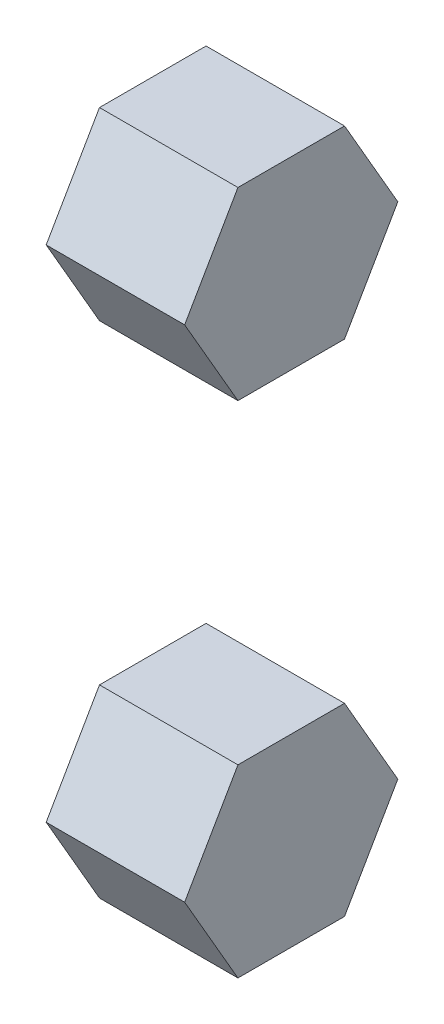
ISO-10303-21;
HEADER;
FILE_DESCRIPTION(('STEP AP214'),'2;1');
FILE_NAME('part.step','',(''),(''),'','','');
FILE_SCHEMA(('AUTOMOTIVE_DESIGN { 1 0 10303 214 1 1 1 1 }'));
ENDSEC;
DATA;
#1=APPLICATION_CONTEXT('core data for automotive mechanical design processes');
#2=APPLICATION_PROTOCOL_DEFINITION('international standard','automotive_design',2000,#1);
#3=PRODUCT_CONTEXT('',#1,'mechanical');
#4=PRODUCT('Part','Part','',(#3));
#5=PRODUCT_RELATED_PRODUCT_CATEGORY('part','',(#4));
#6=PRODUCT_DEFINITION_FORMATION('','',#4);
#7=PRODUCT_DEFINITION_CONTEXT('part definition',#1,'design');
#8=PRODUCT_DEFINITION('design','',#6,#7);
#9=PRODUCT_DEFINITION_SHAPE('','',#8);
#10=(LENGTH_UNIT() NAMED_UNIT(*) SI_UNIT(.MILLI.,.METRE.));
#11=(NAMED_UNIT(*) PLANE_ANGLE_UNIT() SI_UNIT($,.RADIAN.));
#12=(NAMED_UNIT(*) SI_UNIT($,.STERADIAN.) SOLID_ANGLE_UNIT());
#13=UNCERTAINTY_MEASURE_WITH_UNIT(LENGTH_MEASURE(1.E-05),#10,'distance_accuracy_value','');
#14=(GEOMETRIC_REPRESENTATION_CONTEXT(3) GLOBAL_UNCERTAINTY_ASSIGNED_CONTEXT((#13)) GLOBAL_UNIT_ASSIGNED_CONTEXT((#10,
#11,#12)) REPRESENTATION_CONTEXT('',''));
#15=CARTESIAN_POINT('',(0.,0.,0.));
#16=DIRECTION('',(0.,0.,1.));
#17=DIRECTION('',(1.,0.,0.));
#18=AXIS2_PLACEMENT_3D('',#15,#16,#17);
#19=CARTESIAN_POINT('',(18.,613.,183.));
#20=DIRECTION('',(0.,-0.5,-0.86602540378444));
#21=DIRECTION('',(0.,-0.86602540378444,0.5));
#22=AXIS2_PLACEMENT_3D('',#19,#20,#21);
#23=PLANE('',#22);
#24=DIRECTION('',(0.,-0.86602540378444,0.5));
#25=VECTOR('',#24,1.);
#26=CARTESIAN_POINT('',(0.,613.,183.));
#27=LINE('',#26,#25);
#28=CARTESIAN_POINT('',(0.,613.,183.));
#29=VERTEX_POINT('',#28);
#30=CARTESIAN_POINT('',(0.,601.,189.928203230275));
#31=VERTEX_POINT('',#30);
#32=EDGE_CURVE('E144',#29,#31,#27,.T.);
#33=ORIENTED_EDGE('',*,*,#32,.T.);
#34=DIRECTION('',(-1.,0.,0.));
#35=VECTOR('',#34,1.);
#36=CARTESIAN_POINT('',(18.,601.,189.928203230275));
#37=LINE('',#36,#35);
#38=CARTESIAN_POINT('',(18.,601.,189.928203230275));
#39=VERTEX_POINT('',#38);
#40=EDGE_CURVE('E11',#39,#31,#37,.T.);
#41=ORIENTED_EDGE('',*,*,#40,.F.);
#42=DIRECTION('',(0.,-0.86602540378444,0.5));
#43=VECTOR('',#42,1.);
#44=CARTESIAN_POINT('',(18.,613.,183.));
#45=LINE('',#44,#43);
#46=CARTESIAN_POINT('',(18.,613.,183.));
#47=VERTEX_POINT('',#46);
#48=EDGE_CURVE('E587',#47,#39,#45,.T.);
#49=ORIENTED_EDGE('',*,*,#48,.F.);
#50=DIRECTION('',(-1.,0.,0.));
#51=VECTOR('',#50,1.);
#52=CARTESIAN_POINT('',(18.,613.,183.));
#53=LINE('',#52,#51);
#54=EDGE_CURVE('E162',#47,#29,#53,.T.);
#55=ORIENTED_EDGE('',*,*,#54,.T.);
#56=EDGE_LOOP('',(#33,#41,#49,#55));
#57=FACE_BOUND('',#56,.T.);
#58=ADVANCED_FACE('F17',(#57),#23,.F.);
#59=CARTESIAN_POINT('',(18.,601.,189.928203230275));
#60=DIRECTION('',(0.,0.5,-0.86602540378444));
#61=DIRECTION('',(0.,-0.86602540378444,-0.5));
#62=AXIS2_PLACEMENT_3D('',#59,#60,#61);
#63=PLANE('',#62);
#64=DIRECTION('',(0.,-0.86602540378444,-0.5));
#65=VECTOR('',#64,1.);
#66=CARTESIAN_POINT('',(0.,601.,189.928203230275));
#67=LINE('',#66,#65);
#68=CARTESIAN_POINT('',(0.,589.,183.));
#69=VERTEX_POINT('',#68);
#70=EDGE_CURVE('E148',#31,#69,#67,.T.);
#71=ORIENTED_EDGE('',*,*,#70,.T.);
#72=DIRECTION('',(-1.,0.,0.));
#73=VECTOR('',#72,1.);
#74=CARTESIAN_POINT('',(18.,589.,183.));
#75=LINE('',#74,#73);
#76=CARTESIAN_POINT('',(18.,589.,183.));
#77=VERTEX_POINT('',#76);
#78=EDGE_CURVE('E27',#77,#69,#75,.T.);
#79=ORIENTED_EDGE('',*,*,#78,.F.);
#80=DIRECTION('',(0.,-0.86602540378444,-0.5));
#81=VECTOR('',#80,1.);
#82=CARTESIAN_POINT('',(18.,601.,189.928203230275));
#83=LINE('',#82,#81);
#84=EDGE_CURVE('E590',#39,#77,#83,.T.);
#85=ORIENTED_EDGE('',*,*,#84,.F.);
#86=ORIENTED_EDGE('',*,*,#40,.T.);
#87=EDGE_LOOP('',(#71,#79,#85,#86));
#88=FACE_BOUND('',#87,.T.);
#89=ADVANCED_FACE('F393',(#88),#63,.F.);
#90=CARTESIAN_POINT('',(18.,589.,183.));
#91=DIRECTION('',(0.,1.,0.));
#92=DIRECTION('',(0.,0.,-1.));
#93=AXIS2_PLACEMENT_3D('',#90,#91,#92);
#94=PLANE('',#93);
#95=DIRECTION('',(0.,0.,-1.));
#96=VECTOR('',#95,1.);
#97=CARTESIAN_POINT('',(0.,589.,183.));
#98=LINE('',#97,#96);
#99=CARTESIAN_POINT('',(0.,589.,169.143593539449));
#100=VERTEX_POINT('',#99);
#101=EDGE_CURVE('E156',#69,#100,#98,.T.);
#102=ORIENTED_EDGE('',*,*,#101,.T.);
#103=DIRECTION('',(-1.,0.,0.));
#104=VECTOR('',#103,1.);
#105=CARTESIAN_POINT('',(18.,589.,169.143593539449));
#106=LINE('',#105,#104);
#107=CARTESIAN_POINT('',(18.,589.,169.143593539449));
#108=VERTEX_POINT('',#107);
#109=EDGE_CURVE('E170',#108,#100,#106,.T.);
#110=ORIENTED_EDGE('',*,*,#109,.F.);
#111=DIRECTION('',(0.,0.,-1.));
#112=VECTOR('',#111,1.);
#113=CARTESIAN_POINT('',(18.,589.,183.));
#114=LINE('',#113,#112);
#115=EDGE_CURVE('E572',#77,#108,#114,.T.);
#116=ORIENTED_EDGE('',*,*,#115,.F.);
#117=ORIENTED_EDGE('',*,*,#78,.T.);
#118=EDGE_LOOP('',(#102,#110,#116,#117));
#119=FACE_BOUND('',#118,.T.);
#120=ADVANCED_FACE('F381',(#119),#94,.F.);
#121=CARTESIAN_POINT('',(18.,589.,169.143593539449));
#122=DIRECTION('',(0.,0.5,0.86602540378444));
#123=DIRECTION('',(0.,0.86602540378444,-0.5));
#124=AXIS2_PLACEMENT_3D('',#121,#122,#123);
#125=PLANE('',#124);
#126=DIRECTION('',(0.,0.86602540378444,-0.5));
#127=VECTOR('',#126,1.);
#128=CARTESIAN_POINT('',(0.,589.,169.143593539449));
#129=LINE('',#128,#127);
#130=CARTESIAN_POINT('',(0.,601.,162.215390309174));
#131=VERTEX_POINT('',#130);
#132=EDGE_CURVE('E575',#100,#131,#129,.T.);
#133=ORIENTED_EDGE('',*,*,#132,.T.);
#134=DIRECTION('',(-1.,0.,0.));
#135=VECTOR('',#134,1.);
#136=CARTESIAN_POINT('',(18.,601.,162.215390309174));
#137=LINE('',#136,#135);
#138=CARTESIAN_POINT('',(18.,601.,162.215390309174));
#139=VERTEX_POINT('',#138);
#140=EDGE_CURVE('E167',#139,#131,#137,.T.);
#141=ORIENTED_EDGE('',*,*,#140,.F.);
#142=DIRECTION('',(0.,0.86602540378444,-0.5));
#143=VECTOR('',#142,1.);
#144=CARTESIAN_POINT('',(18.,589.,169.143593539449));
#145=LINE('',#144,#143);
#146=EDGE_CURVE('E598',#108,#139,#145,.T.);
#147=ORIENTED_EDGE('',*,*,#146,.F.);
#148=ORIENTED_EDGE('',*,*,#109,.T.);
#149=EDGE_LOOP('',(#133,#141,#147,#148));
#150=FACE_BOUND('',#149,.T.);
#151=ADVANCED_FACE('F369',(#150),#125,.F.);
#152=CARTESIAN_POINT('',(18.,601.,162.215390309174));
#153=DIRECTION('',(0.,-0.5,0.86602540378444));
#154=DIRECTION('',(0.,0.86602540378444,0.5));
#155=AXIS2_PLACEMENT_3D('',#152,#153,#154);
#156=PLANE('',#155);
#157=DIRECTION('',(0.,0.86602540378444,0.5));
#158=VECTOR('',#157,1.);
#159=CARTESIAN_POINT('',(0.,601.,162.215390309174));
#160=LINE('',#159,#158);
#161=CARTESIAN_POINT('',(0.,613.,169.143593539449));
#162=VERTEX_POINT('',#161);
#163=EDGE_CURVE('E580',#131,#162,#160,.T.);
#164=ORIENTED_EDGE('',*,*,#163,.T.);
#165=DIRECTION('',(-1.,0.,0.));
#166=VECTOR('',#165,1.);
#167=CARTESIAN_POINT('',(18.,613.,169.143593539449));
#168=LINE('',#167,#166);
#169=CARTESIAN_POINT('',(18.,613.,169.143593539449));
#170=VERTEX_POINT('',#169);
#171=EDGE_CURVE('E164',#170,#162,#168,.T.);
#172=ORIENTED_EDGE('',*,*,#171,.F.);
#173=DIRECTION('',(0.,0.86602540378444,0.5));
#174=VECTOR('',#173,1.);
#175=CARTESIAN_POINT('',(18.,601.,162.215390309174));
#176=LINE('',#175,#174);
#177=EDGE_CURVE('E596',#139,#170,#176,.T.);
#178=ORIENTED_EDGE('',*,*,#177,.F.);
#179=ORIENTED_EDGE('',*,*,#140,.T.);
#180=EDGE_LOOP('',(#164,#172,#178,#179));
#181=FACE_BOUND('',#180,.T.);
#182=ADVANCED_FACE('F357',(#181),#156,.F.);
#183=CARTESIAN_POINT('',(18.,613.,169.143593539449));
#184=DIRECTION('',(0.,-1.,0.));
#185=DIRECTION('',(0.,0.,1.));
#186=AXIS2_PLACEMENT_3D('',#183,#184,#185);
#187=PLANE('',#186);
#188=DIRECTION('',(0.,0.,1.));
#189=VECTOR('',#188,1.);
#190=CARTESIAN_POINT('',(0.,613.,169.143593539449));
#191=LINE('',#190,#189);
#192=EDGE_CURVE('E160',#162,#29,#191,.T.);
#193=ORIENTED_EDGE('',*,*,#192,.T.);
#194=ORIENTED_EDGE('',*,*,#54,.F.);
#195=DIRECTION('',(0.,0.,1.));
#196=VECTOR('',#195,1.);
#197=CARTESIAN_POINT('',(18.,613.,169.143593539449));
#198=LINE('',#197,#196);
#199=EDGE_CURVE('E36',#170,#47,#198,.T.);
#200=ORIENTED_EDGE('',*,*,#199,.F.);
#201=ORIENTED_EDGE('',*,*,#171,.T.);
#202=EDGE_LOOP('',(#193,#194,#200,#201));
#203=FACE_BOUND('',#202,.T.);
#204=ADVANCED_FACE('F346',(#203),#187,.F.);
#205=CARTESIAN_POINT('',(18.,601.,176.071796769725));
#206=DIRECTION('',(1.,0.,0.));
#207=DIRECTION('',(0.,0.,-1.));
#208=AXIS2_PLACEMENT_3D('',#205,#206,#207);
#209=PLANE('',#208);
#210=ORIENTED_EDGE('',*,*,#48,.T.);
#211=ORIENTED_EDGE('',*,*,#84,.T.);
#212=ORIENTED_EDGE('',*,*,#115,.T.);
#213=ORIENTED_EDGE('',*,*,#146,.T.);
#214=ORIENTED_EDGE('',*,*,#177,.T.);
#215=ORIENTED_EDGE('',*,*,#199,.T.);
#216=EDGE_LOOP('',(#210,#211,#212,#213,#214,#215));
#217=FACE_BOUND('',#216,.T.);
#218=ADVANCED_FACE('F336',(#217),#209,.T.);
#219=CARTESIAN_POINT('',(0.,601.,176.071796769725));
#220=DIRECTION('',(1.,0.,0.));
#221=DIRECTION('',(0.,0.,-1.));
#222=AXIS2_PLACEMENT_3D('',#219,#220,#221);
#223=PLANE('',#222);
#224=ORIENTED_EDGE('',*,*,#32,.F.);
#225=ORIENTED_EDGE('',*,*,#192,.F.);
#226=ORIENTED_EDGE('',*,*,#163,.F.);
#227=ORIENTED_EDGE('',*,*,#132,.F.);
#228=ORIENTED_EDGE('',*,*,#101,.F.);
#229=ORIENTED_EDGE('',*,*,#70,.F.);
#230=EDGE_LOOP('',(#224,#225,#226,#227,#228,#229));
#231=FACE_BOUND('',#230,.T.);
#232=ADVANCED_FACE('F232',(#231),#223,.F.);
#233=CLOSED_SHELL('',(#58,#89,#120,#151,#182,#204,#218,#232));
#234=MANIFOLD_SOLID_BREP('B1',#233);
#235=CARTESIAN_POINT('',(0.,654.,183.));
#236=DIRECTION('',(0.,0.5,-0.86602540378444));
#237=DIRECTION('',(0.,0.86602540378444,0.5));
#238=AXIS2_PLACEMENT_3D('',#235,#236,#237);
#239=PLANE('',#238);
#240=DIRECTION('',(0.,0.86602540378444,0.5));
#241=VECTOR('',#240,1.);
#242=CARTESIAN_POINT('',(18.,654.,183.));
#243=LINE('',#242,#241);
#244=CARTESIAN_POINT('',(18.,654.,183.));
#245=VERTEX_POINT('',#244);
#246=CARTESIAN_POINT('',(18.,666.,189.928203230275));
#247=VERTEX_POINT('',#246);
#248=EDGE_CURVE('E117',#245,#247,#243,.T.);
#249=ORIENTED_EDGE('',*,*,#248,.T.);
#250=DIRECTION('',(1.,0.,0.));
#251=VECTOR('',#250,1.);
#252=CARTESIAN_POINT('',(0.,666.,189.928203230275));
#253=LINE('',#252,#251);
#254=CARTESIAN_POINT('',(0.,666.,189.928203230275));
#255=VERTEX_POINT('',#254);
#256=EDGE_CURVE('E21',#255,#247,#253,.T.);
#257=ORIENTED_EDGE('',*,*,#256,.F.);
#258=DIRECTION('',(0.,0.86602540378444,0.5));
#259=VECTOR('',#258,1.);
#260=CARTESIAN_POINT('',(0.,654.,183.));
#261=LINE('',#260,#259);
#262=CARTESIAN_POINT('',(0.,654.,183.));
#263=VERTEX_POINT('',#262);
#264=EDGE_CURVE('E112',#263,#255,#261,.T.);
#265=ORIENTED_EDGE('',*,*,#264,.F.);
#266=DIRECTION('',(1.,0.,0.));
#267=VECTOR('',#266,1.);
#268=CARTESIAN_POINT('',(0.,654.,183.));
#269=LINE('',#268,#267);
#270=EDGE_CURVE('E106',#263,#245,#269,.T.);
#271=ORIENTED_EDGE('',*,*,#270,.T.);
#272=EDGE_LOOP('',(#249,#257,#265,#271));
#273=FACE_BOUND('',#272,.T.);
#274=ADVANCED_FACE('F19',(#273),#239,.F.);
#275=CARTESIAN_POINT('',(0.,666.,189.928203230275));
#276=DIRECTION('',(0.,-0.5,-0.86602540378444));
#277=DIRECTION('',(0.,0.86602540378444,-0.5));
#278=AXIS2_PLACEMENT_3D('',#275,#276,#277);
#279=PLANE('',#278);
#280=DIRECTION('',(0.,0.86602540378444,-0.5));
#281=VECTOR('',#280,1.);
#282=CARTESIAN_POINT('',(18.,666.,189.928203230275));
#283=LINE('',#282,#281);
#284=CARTESIAN_POINT('',(18.,678.,183.));
#285=VERTEX_POINT('',#284);
#286=EDGE_CURVE('E123',#247,#285,#283,.T.);
#287=ORIENTED_EDGE('',*,*,#286,.T.);
#288=DIRECTION('',(1.,0.,0.));
#289=VECTOR('',#288,1.);
#290=CARTESIAN_POINT('',(0.,678.,183.));
#291=LINE('',#290,#289);
#292=CARTESIAN_POINT('',(0.,678.,183.));
#293=VERTEX_POINT('',#292);
#294=EDGE_CURVE('E139',#293,#285,#291,.T.);
#295=ORIENTED_EDGE('',*,*,#294,.F.);
#296=DIRECTION('',(0.,0.86602540378444,-0.5));
#297=VECTOR('',#296,1.);
#298=CARTESIAN_POINT('',(0.,666.,189.928203230275));
#299=LINE('',#298,#297);
#300=EDGE_CURVE('E175',#255,#293,#299,.T.);
#301=ORIENTED_EDGE('',*,*,#300,.F.);
#302=ORIENTED_EDGE('',*,*,#256,.T.);
#303=EDGE_LOOP('',(#287,#295,#301,#302));
#304=FACE_BOUND('',#303,.T.);
#305=ADVANCED_FACE('F209',(#304),#279,.F.);
#306=CARTESIAN_POINT('',(0.,678.,183.));
#307=DIRECTION('',(0.,-1.,0.));
#308=DIRECTION('',(0.,0.,-1.));
#309=AXIS2_PLACEMENT_3D('',#306,#307,#308);
#310=PLANE('',#309);
#311=DIRECTION('',(0.,0.,-1.));
#312=VECTOR('',#311,1.);
#313=CARTESIAN_POINT('',(18.,678.,183.));
#314=LINE('',#313,#312);
#315=CARTESIAN_POINT('',(18.,678.,169.143593539449));
#316=VERTEX_POINT('',#315);
#317=EDGE_CURVE('E130',#285,#316,#314,.T.);
#318=ORIENTED_EDGE('',*,*,#317,.T.);
#319=DIRECTION('',(1.,0.,0.));
#320=VECTOR('',#319,1.);
#321=CARTESIAN_POINT('',(0.,678.,169.143593539449));
#322=LINE('',#321,#320);
#323=CARTESIAN_POINT('',(0.,678.,169.143593539449));
#324=VERTEX_POINT('',#323);
#325=EDGE_CURVE('E137',#324,#316,#322,.T.);
#326=ORIENTED_EDGE('',*,*,#325,.F.);
#327=DIRECTION('',(0.,0.,-1.));
#328=VECTOR('',#327,1.);
#329=CARTESIAN_POINT('',(0.,678.,183.));
#330=LINE('',#329,#328);
#331=EDGE_CURVE('E177',#293,#324,#330,.T.);
#332=ORIENTED_EDGE('',*,*,#331,.F.);
#333=ORIENTED_EDGE('',*,*,#294,.T.);
#334=EDGE_LOOP('',(#318,#326,#332,#333));
#335=FACE_BOUND('',#334,.T.);
#336=ADVANCED_FACE('F207',(#335),#310,.F.);
#337=CARTESIAN_POINT('',(0.,678.,169.143593539449));
#338=DIRECTION('',(0.,-0.5,0.86602540378444));
#339=DIRECTION('',(0.,-0.86602540378444,-0.5));
#340=AXIS2_PLACEMENT_3D('',#337,#338,#339);
#341=PLANE('',#340);
#342=DIRECTION('',(0.,-0.86602540378444,-0.5));
#343=VECTOR('',#342,1.);
#344=CARTESIAN_POINT('',(18.,678.,169.143593539449));
#345=LINE('',#344,#343);
#346=CARTESIAN_POINT('',(18.,666.,162.215390309174));
#347=VERTEX_POINT('',#346);
#348=EDGE_CURVE('E187',#316,#347,#345,.T.);
#349=ORIENTED_EDGE('',*,*,#348,.T.);
#350=DIRECTION('',(1.,0.,0.));
#351=VECTOR('',#350,1.);
#352=CARTESIAN_POINT('',(0.,666.,162.215390309174));
#353=LINE('',#352,#351);
#354=CARTESIAN_POINT('',(0.,666.,162.215390309174));
#355=VERTEX_POINT('',#354);
#356=EDGE_CURVE('E135',#355,#347,#353,.T.);
#357=ORIENTED_EDGE('',*,*,#356,.F.);
#358=DIRECTION('',(0.,-0.86602540378444,-0.5));
#359=VECTOR('',#358,1.);
#360=CARTESIAN_POINT('',(0.,678.,169.143593539449));
#361=LINE('',#360,#359);
#362=EDGE_CURVE('E179',#324,#355,#361,.T.);
#363=ORIENTED_EDGE('',*,*,#362,.F.);
#364=ORIENTED_EDGE('',*,*,#325,.T.);
#365=EDGE_LOOP('',(#349,#357,#363,#364));
#366=FACE_BOUND('',#365,.T.);
#367=ADVANCED_FACE('F200',(#366),#341,.F.);
#368=CARTESIAN_POINT('',(0.,666.,162.215390309174));
#369=DIRECTION('',(0.,0.5,0.86602540378444));
#370=DIRECTION('',(0.,-0.86602540378444,0.5));
#371=AXIS2_PLACEMENT_3D('',#368,#369,#370);
#372=PLANE('',#371);
#373=DIRECTION('',(0.,-0.86602540378444,0.5));
#374=VECTOR('',#373,1.);
#375=CARTESIAN_POINT('',(18.,666.,162.215390309174));
#376=LINE('',#375,#374);
#377=CARTESIAN_POINT('',(18.,654.,169.143593539449));
#378=VERTEX_POINT('',#377);
#379=EDGE_CURVE('E96',#347,#378,#376,.T.);
#380=ORIENTED_EDGE('',*,*,#379,.T.);
#381=DIRECTION('',(1.,0.,0.));
#382=VECTOR('',#381,1.);
#383=CARTESIAN_POINT('',(0.,654.,169.143593539449));
#384=LINE('',#383,#382);
#385=CARTESIAN_POINT('',(0.,654.,169.143593539449));
#386=VERTEX_POINT('',#385);
#387=EDGE_CURVE('E108',#386,#378,#384,.T.);
#388=ORIENTED_EDGE('',*,*,#387,.F.);
#389=DIRECTION('',(0.,-0.86602540378444,0.5));
#390=VECTOR('',#389,1.);
#391=CARTESIAN_POINT('',(0.,666.,162.215390309174));
#392=LINE('',#391,#390);
#393=EDGE_CURVE('E181',#355,#386,#392,.T.);
#394=ORIENTED_EDGE('',*,*,#393,.F.);
#395=ORIENTED_EDGE('',*,*,#356,.T.);
#396=EDGE_LOOP('',(#380,#388,#394,#395));
#397=FACE_BOUND('',#396,.T.);
#398=ADVANCED_FACE('F204',(#397),#372,.F.);
#399=CARTESIAN_POINT('',(0.,654.,169.143593539449));
#400=DIRECTION('',(0.,1.,0.));
#401=DIRECTION('',(0.,0.,1.));
#402=AXIS2_PLACEMENT_3D('',#399,#400,#401);
#403=PLANE('',#402);
#404=DIRECTION('',(0.,0.,1.));
#405=VECTOR('',#404,1.);
#406=CARTESIAN_POINT('',(18.,654.,169.143593539449));
#407=LINE('',#406,#405);
#408=EDGE_CURVE('E102',#378,#245,#407,.T.);
#409=ORIENTED_EDGE('',*,*,#408,.T.);
#410=ORIENTED_EDGE('',*,*,#270,.F.);
#411=DIRECTION('',(0.,0.,1.));
#412=VECTOR('',#411,1.);
#413=CARTESIAN_POINT('',(0.,654.,169.143593539449));
#414=LINE('',#413,#412);
#415=EDGE_CURVE('E119',#386,#263,#414,.T.);
#416=ORIENTED_EDGE('',*,*,#415,.F.);
#417=ORIENTED_EDGE('',*,*,#387,.T.);
#418=EDGE_LOOP('',(#409,#410,#416,#417));
#419=FACE_BOUND('',#418,.T.);
#420=ADVANCED_FACE('F104',(#419),#403,.F.);
#421=CARTESIAN_POINT('',(0.,666.,176.071796769725));
#422=DIRECTION('',(-1.,0.,0.));
#423=DIRECTION('',(0.,0.,-1.));
#424=AXIS2_PLACEMENT_3D('',#421,#422,#423);
#425=PLANE('',#424);
#426=ORIENTED_EDGE('',*,*,#264,.T.);
#427=ORIENTED_EDGE('',*,*,#300,.T.);
#428=ORIENTED_EDGE('',*,*,#331,.T.);
#429=ORIENTED_EDGE('',*,*,#362,.T.);
#430=ORIENTED_EDGE('',*,*,#393,.T.);
#431=ORIENTED_EDGE('',*,*,#415,.T.);
#432=EDGE_LOOP('',(#426,#427,#428,#429,#430,#431));
#433=FACE_BOUND('',#432,.T.);
#434=ADVANCED_FACE('F206',(#433),#425,.T.);
#435=CARTESIAN_POINT('',(18.,666.,176.071796769725));
#436=DIRECTION('',(-1.,0.,0.));
#437=DIRECTION('',(0.,0.,-1.));
#438=AXIS2_PLACEMENT_3D('',#435,#436,#437);
#439=PLANE('',#438);
#440=ORIENTED_EDGE('',*,*,#248,.F.);
#441=ORIENTED_EDGE('',*,*,#408,.F.);
#442=ORIENTED_EDGE('',*,*,#379,.F.);
#443=ORIENTED_EDGE('',*,*,#348,.F.);
#444=ORIENTED_EDGE('',*,*,#317,.F.);
#445=ORIENTED_EDGE('',*,*,#286,.F.);
#446=EDGE_LOOP('',(#440,#441,#442,#443,#444,#445));
#447=FACE_BOUND('',#446,.T.);
#448=ADVANCED_FACE('F121',(#447),#439,.F.);
#449=CLOSED_SHELL('',(#274,#305,#336,#367,#398,#420,#434,#448));
#450=MANIFOLD_SOLID_BREP('B1',#449);
#451=ADVANCED_BREP_SHAPE_REPRESENTATION('',(#18,#234,#450),#14);
#452=SHAPE_DEFINITION_REPRESENTATION(#9,#451);
ENDSEC;
END-ISO-10303-21;
